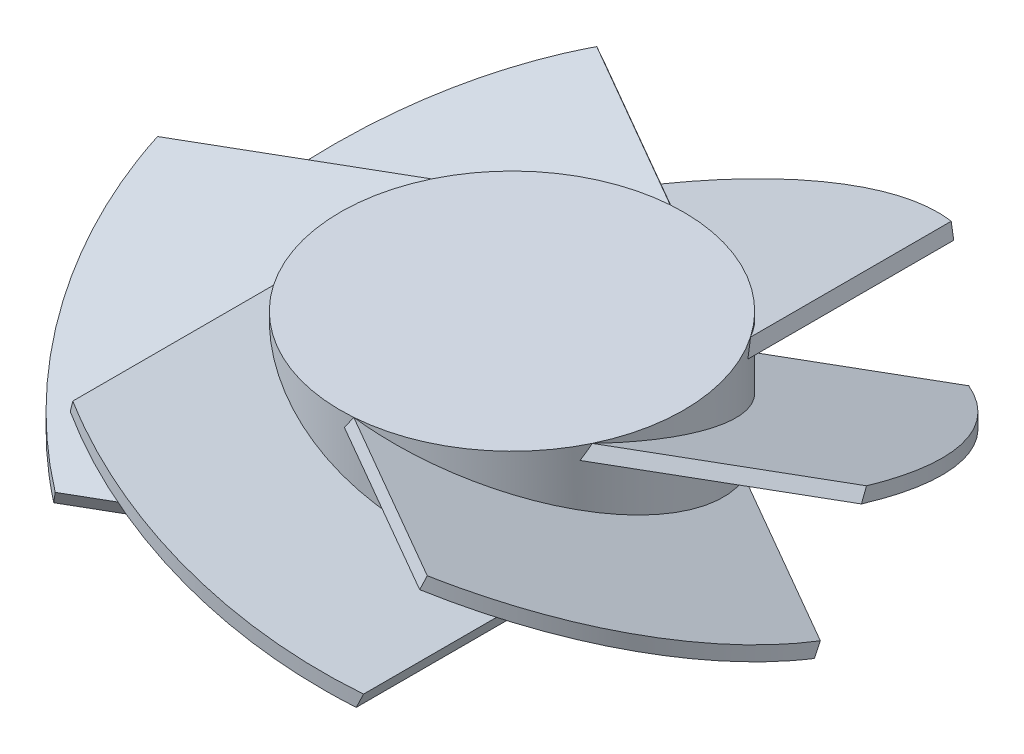
ISO-10303-21;
HEADER;
FILE_DESCRIPTION(('STEP AP214'),'2;1');
FILE_NAME('part.step','',(''),(''),'','','');
FILE_SCHEMA(('AUTOMOTIVE_DESIGN { 1 0 10303 214 1 1 1 1 }'));
ENDSEC;
DATA;
#1=APPLICATION_CONTEXT('core data for automotive mechanical design processes');
#2=APPLICATION_PROTOCOL_DEFINITION('international standard','automotive_design',2000,#1);
#3=PRODUCT_CONTEXT('',#1,'mechanical');
#4=PRODUCT('Part','Part','',(#3));
#5=PRODUCT_RELATED_PRODUCT_CATEGORY('part','',(#4));
#6=PRODUCT_DEFINITION_FORMATION('','',#4);
#7=PRODUCT_DEFINITION_CONTEXT('part definition',#1,'design');
#8=PRODUCT_DEFINITION('design','',#6,#7);
#9=PRODUCT_DEFINITION_SHAPE('','',#8);
#10=(LENGTH_UNIT() NAMED_UNIT(*) SI_UNIT(.MILLI.,.METRE.));
#11=(NAMED_UNIT(*) PLANE_ANGLE_UNIT() SI_UNIT($,.RADIAN.));
#12=(NAMED_UNIT(*) SI_UNIT($,.STERADIAN.) SOLID_ANGLE_UNIT());
#13=UNCERTAINTY_MEASURE_WITH_UNIT(LENGTH_MEASURE(1.E-05),#10,'distance_accuracy_value','');
#14=(GEOMETRIC_REPRESENTATION_CONTEXT(3) GLOBAL_UNCERTAINTY_ASSIGNED_CONTEXT((#13)) GLOBAL_UNIT_ASSIGNED_CONTEXT((#10,
#11,#12)) REPRESENTATION_CONTEXT('',''));
#15=CARTESIAN_POINT('',(0.,0.,0.));
#16=DIRECTION('',(0.,0.,1.));
#17=DIRECTION('',(1.,0.,0.));
#18=AXIS2_PLACEMENT_3D('',#15,#16,#17);
#19=CARTESIAN_POINT('',(-20.6458228220629,18.,10.0000000000001));
#20=DIRECTION('',(0.933525901422193,-0.358509959936795,0.));
#21=DIRECTION('',(0.358509959936795,0.933525901422193,0.));
#22=AXIS2_PLACEMENT_3D('',#19,#20,#21);
#23=PLANE('',#22);
#24=CARTESIAN_POINT('',(0.,71.7597626687053,0.));
#25=DIRECTION('',(0.933525901422193,-0.358509959936795,0.));
#26=DIRECTION('',(0.358509959936795,0.933525901422193,0.));
#27=AXIS2_PLACEMENT_3D('',#24,#25,#26);
#28=ELLIPSE('',#27,133.887493693236,48.0000000000001);
#29=CARTESIAN_POINT('',(-20.6458228220626,18.,43.3330128193276));
#30=VERTEX_POINT('',#29);
#31=CARTESIAN_POINT('',(-21.3628427419362,16.1329481971556,42.9840546014835));
#32=VERTEX_POINT('',#31);
#33=EDGE_CURVE('E498',#30,#32,#28,.T.);
#34=ORIENTED_EDGE('',*,*,#33,.F.);
#35=DIRECTION('',(0.,0.,1.));
#36=VECTOR('',#35,1.);
#37=CARTESIAN_POINT('',(-20.6458228220629,18.,10.0000000000001));
#38=LINE('',#37,#36);
#39=CARTESIAN_POINT('',(-20.6458228220628,18.,14.0978721798713));
#40=VERTEX_POINT('',#39);
#41=EDGE_CURVE('E390',#40,#30,#38,.T.);
#42=ORIENTED_EDGE('',*,*,#41,.F.);
#43=CARTESIAN_POINT('',(0.,71.7597626687053,0.));
#44=DIRECTION('',(0.933525901422193,-0.358509959936795,0.));
#45=DIRECTION('',(-0.358509959936795,-0.933525901422193,0.));
#46=AXIS2_PLACEMENT_3D('',#43,#44,#45);
#47=ELLIPSE('',#46,69.7330696318938,25.);
#48=CARTESIAN_POINT('',(-21.3628427419364,16.1329481971556,12.9857210035983));
#49=VERTEX_POINT('',#48);
#50=EDGE_CURVE('E414',#40,#49,#47,.T.);
#51=ORIENTED_EDGE('',*,*,#50,.T.);
#52=DIRECTION('',(0.,0.,1.));
#53=VECTOR('',#52,1.);
#54=CARTESIAN_POINT('',(-21.3628427419364,16.1329481971556,10.0000000000001));
#55=LINE('',#54,#53);
#56=EDGE_CURVE('E394',#49,#32,#55,.T.);
#57=ORIENTED_EDGE('',*,*,#56,.T.);
#58=EDGE_LOOP('',(#34,#42,#51,#57));
#59=FACE_BOUND('',#58,.T.);
#60=ADVANCED_FACE('F45',(#59),#23,.F.);
#61=CARTESIAN_POINT('',(21.3628427419359,1.8670518028444,9.99999999999986));
#62=DIRECTION('',(-0.358509959936791,-0.933525901422194,0.));
#63=DIRECTION('',(0.933525901422194,-0.358509959936791,0.));
#64=AXIS2_PLACEMENT_3D('',#61,#62,#63);
#65=PLANE('',#64);
#66=CARTESIAN_POINT('',(0.,10.0712075567228,0.));
#67=DIRECTION('',(-0.358509959936791,-0.933525901422194,0.));
#68=DIRECTION('',(-0.933525901422194,0.358509959936791,0.));
#69=AXIS2_PLACEMENT_3D('',#66,#67,#68);
#70=ELLIPSE('',#69,51.4179627226988,48.0000000000001);
#71=CARTESIAN_POINT('',(21.3628427419361,1.8670518028444,42.9840546014836));
#72=VERTEX_POINT('',#71);
#73=EDGE_CURVE('E501',#72,#30,#70,.T.);
#74=ORIENTED_EDGE('',*,*,#73,.F.);
#75=DIRECTION('',(0.,0.,1.));
#76=VECTOR('',#75,1.);
#77=CARTESIAN_POINT('',(21.3628427419359,1.8670518028444,9.99999999999986));
#78=LINE('',#77,#76);
#79=CARTESIAN_POINT('',(21.3628427419359,1.8670518028444,12.9857210035991));
#80=VERTEX_POINT('',#79);
#81=EDGE_CURVE('E386',#80,#72,#78,.T.);
#82=ORIENTED_EDGE('',*,*,#81,.F.);
#83=CARTESIAN_POINT('',(0.,10.0712075567228,0.));
#84=DIRECTION('',(-0.358509959936791,-0.933525901422194,0.));
#85=DIRECTION('',(0.933525901422194,-0.358509959936791,0.));
#86=AXIS2_PLACEMENT_3D('',#83,#84,#85);
#87=ELLIPSE('',#86,26.7801889180722,25.);
#88=EDGE_CURVE('E410',#80,#40,#87,.T.);
#89=ORIENTED_EDGE('',*,*,#88,.T.);
#90=ORIENTED_EDGE('',*,*,#41,.T.);
#91=EDGE_LOOP('',(#74,#82,#89,#90));
#92=FACE_BOUND('',#91,.T.);
#93=ADVANCED_FACE('F514',(#92),#65,.F.);
#94=CARTESIAN_POINT('',(21.3628427419359,1.8670518028444,9.99999999999986));
#95=DIRECTION('',(-0.933525901422194,0.358509959936791,0.));
#96=DIRECTION('',(-0.358509959936791,-0.933525901422194,0.));
#97=AXIS2_PLACEMENT_3D('',#94,#95,#96);
#98=PLANE('',#97);
#99=CARTESIAN_POINT('',(0.,-53.7597626687042,0.));
#100=DIRECTION('',(-0.933525901422194,0.358509959936791,0.));
#101=DIRECTION('',(0.358509959936791,0.933525901422194,0.));
#102=AXIS2_PLACEMENT_3D('',#99,#100,#101);
#103=ELLIPSE('',#102,133.887493693238,48.0000000000001);
#104=CARTESIAN_POINT('',(20.6458228220625,0.,43.3330128193276));
#105=VERTEX_POINT('',#104);
#106=EDGE_CURVE('E486',#105,#72,#103,.T.);
#107=ORIENTED_EDGE('',*,*,#106,.F.);
#108=DIRECTION('',(0.,0.,1.));
#109=VECTOR('',#108,1.);
#110=CARTESIAN_POINT('',(20.6458228220623,0.,9.99999999999986));
#111=LINE('',#110,#109);
#112=CARTESIAN_POINT('',(20.6458228220624,0.,14.097872179872));
#113=VERTEX_POINT('',#112);
#114=EDGE_CURVE('E398',#113,#105,#111,.T.);
#115=ORIENTED_EDGE('',*,*,#114,.F.);
#116=CARTESIAN_POINT('',(0.,-53.7597626687042,0.));
#117=DIRECTION('',(-0.933525901422194,0.358509959936791,0.));
#118=DIRECTION('',(-0.358509959936791,-0.933525901422194,0.));
#119=AXIS2_PLACEMENT_3D('',#116,#117,#118);
#120=ELLIPSE('',#119,69.7330696318946,25.);
#121=EDGE_CURVE('E406',#113,#80,#120,.T.);
#122=ORIENTED_EDGE('',*,*,#121,.T.);
#123=ORIENTED_EDGE('',*,*,#81,.T.);
#124=EDGE_LOOP('',(#107,#115,#122,#123));
#125=FACE_BOUND('',#124,.T.);
#126=ADVANCED_FACE('F520',(#125),#98,.F.);
#127=CARTESIAN_POINT('',(20.6458228220623,0.,9.99999999999986));
#128=DIRECTION('',(0.358509959936791,0.933525901422194,0.));
#129=DIRECTION('',(-0.933525901422194,0.358509959936791,0.));
#130=AXIS2_PLACEMENT_3D('',#127,#128,#129);
#131=PLANE('',#130);
#132=CARTESIAN_POINT('',(0.,7.92879244327699,0.));
#133=DIRECTION('',(0.358509959936791,0.933525901422194,0.));
#134=DIRECTION('',(-0.933525901422194,0.358509959936791,0.));
#135=AXIS2_PLACEMENT_3D('',#132,#133,#134);
#136=ELLIPSE('',#135,51.4179627226988,48.0000000000001);
#137=EDGE_CURVE('E241',#32,#105,#136,.T.);
#138=ORIENTED_EDGE('',*,*,#137,.F.);
#139=ORIENTED_EDGE('',*,*,#56,.F.);
#140=CARTESIAN_POINT('',(0.,7.92879244327699,0.));
#141=DIRECTION('',(0.358509959936791,0.933525901422194,0.));
#142=DIRECTION('',(0.933525901422194,-0.358509959936791,0.));
#143=AXIS2_PLACEMENT_3D('',#140,#141,#142);
#144=ELLIPSE('',#143,26.7801889180722,25.);
#145=EDGE_CURVE('E402',#49,#113,#144,.T.);
#146=ORIENTED_EDGE('',*,*,#145,.T.);
#147=ORIENTED_EDGE('',*,*,#114,.T.);
#148=EDGE_LOOP('',(#138,#139,#146,#147));
#149=FACE_BOUND('',#148,.T.);
#150=ADVANCED_FACE('F511',(#149),#131,.F.);
#151=CARTESIAN_POINT('',(-18.9831654488759,18.,-12.8798070459389));
#152=DIRECTION('',(0.4667629507111,-0.358509959936795,0.808457145722384));
#153=DIRECTION('',(0.866025403784436,0.,-0.500000000000004));
#154=AXIS2_PLACEMENT_3D('',#151,#152,#153);
#155=PLANE('',#154);
#156=CARTESIAN_POINT('',(0.,71.7597626687053,0.));
#157=DIRECTION('',(0.4667629507111,-0.358509959936795,0.808457145722384));
#158=DIRECTION('',(0.179254979968399,0.933525901422193,0.310478732815005));
#159=AXIS2_PLACEMENT_3D('',#156,#157,#158);
#160=ELLIPSE('',#159,133.887493693236,48.0000000000001);
#161=CARTESIAN_POINT('',(-47.8504013350858,18.,3.78669936372492));
#162=VERTEX_POINT('',#161);
#163=CARTESIAN_POINT('',(-47.9067046135103,16.1329481971556,2.99126278917287));
#164=VERTEX_POINT('',#163);
#165=EDGE_CURVE('E487',#162,#164,#160,.T.);
#166=ORIENTED_EDGE('',*,*,#165,.F.);
#167=DIRECTION('',(-0.866025403784436,0.,0.500000000000004));
#168=VECTOR('',#167,1.);
#169=CARTESIAN_POINT('',(-18.9831654488759,18.,-12.8798070459389));
#170=LINE('',#169,#168);
#171=CARTESIAN_POINT('',(-22.5320268581058,18.,-10.8308709560033));
#172=VERTEX_POINT('',#171);
#173=EDGE_CURVE('E358',#172,#162,#170,.T.);
#174=ORIENTED_EDGE('',*,*,#173,.F.);
#175=CARTESIAN_POINT('',(0.,71.7597626687053,0.));
#176=DIRECTION('',(0.4667629507111,-0.358509959936795,0.808457145722384));
#177=DIRECTION('',(-0.179254979968399,-0.933525901422193,-0.310478732815005));
#178=AXIS2_PLACEMENT_3D('',#175,#176,#177);
#179=ELLIPSE('',#178,69.7330696318938,25.);
#180=CARTESIAN_POINT('',(-21.9273856465415,16.1329481971556,-12.0079040097699));
#181=VERTEX_POINT('',#180);
#182=EDGE_CURVE('E382',#172,#181,#179,.T.);
#183=ORIENTED_EDGE('',*,*,#182,.T.);
#184=DIRECTION('',(-0.866025403784436,0.,0.500000000000004));
#185=VECTOR('',#184,1.);
#186=CARTESIAN_POINT('',(-19.3416754088127,16.1329481971556,-13.5007645115689));
#187=LINE('',#186,#185);
#188=EDGE_CURVE('E362',#181,#164,#187,.T.);
#189=ORIENTED_EDGE('',*,*,#188,.T.);
#190=EDGE_LOOP('',(#166,#174,#183,#189));
#191=FACE_BOUND('',#190,.T.);
#192=ADVANCED_FACE('F527',(#191),#155,.F.);
#193=CARTESIAN_POINT('',(2.02116733312363,1.8670518028444,23.5007645115684));
#194=DIRECTION('',(-0.179254979968397,-0.933525901422194,-0.310478732815002));
#195=DIRECTION('',(0.,0.315590462308943,-0.948895494825235));
#196=AXIS2_PLACEMENT_3D('',#193,#194,#195);
#197=PLANE('',#196);
#198=CARTESIAN_POINT('',(0.,10.0712075567228,0.));
#199=DIRECTION('',(-0.179254979968397,-0.933525901422194,-0.310478732815002));
#200=DIRECTION('',(-0.466762950711101,0.358509959936791,-0.808457145722386));
#201=AXIS2_PLACEMENT_3D('',#198,#199,#200);
#202=ELLIPSE('',#201,51.4179627226988,48.0000000000001);
#203=CARTESIAN_POINT('',(-26.5438618715742,1.8670518028444,39.9927918123104));
#204=VERTEX_POINT('',#203);
#205=EDGE_CURVE('E491',#204,#162,#202,.T.);
#206=ORIENTED_EDGE('',*,*,#205,.F.);
#207=DIRECTION('',(-0.866025403784436,0.,0.500000000000004));
#208=VECTOR('',#207,1.);
#209=CARTESIAN_POINT('',(2.02116733312363,1.8670518028444,23.5007645115684));
#210=LINE('',#209,#208);
#211=CARTESIAN_POINT('',(-0.564542904606123,1.8670518028444,24.9936250133681));
#212=VERTEX_POINT('',#211);
#213=EDGE_CURVE('E354',#212,#204,#210,.T.);
#214=ORIENTED_EDGE('',*,*,#213,.F.);
#215=CARTESIAN_POINT('',(0.,10.0712075567228,0.));
#216=DIRECTION('',(-0.179254979968397,-0.933525901422194,-0.310478732815002));
#217=DIRECTION('',(0.466762950711101,-0.358509959936791,0.808457145722386));
#218=AXIS2_PLACEMENT_3D('',#215,#216,#217);
#219=ELLIPSE('',#218,26.7801889180722,25.);
#220=EDGE_CURVE('E378',#212,#172,#219,.T.);
#221=ORIENTED_EDGE('',*,*,#220,.T.);
#222=ORIENTED_EDGE('',*,*,#173,.T.);
#223=EDGE_LOOP('',(#206,#214,#221,#222));
#224=FACE_BOUND('',#223,.T.);
#225=ADVANCED_FACE('F571',(#224),#197,.F.);
#226=CARTESIAN_POINT('',(2.02116733312363,1.8670518028444,23.5007645115684));
#227=DIRECTION('',(-0.466762950711101,0.358509959936791,-0.808457145722386));
#228=DIRECTION('',(-0.866025403784436,0.,0.500000000000004));
#229=AXIS2_PLACEMENT_3D('',#226,#227,#228);
#230=PLANE('',#229);
#231=CARTESIAN_POINT('',(0.,-53.7597626687042,0.));
#232=DIRECTION('',(-0.466762950711101,0.358509959936791,-0.808457145722386));
#233=DIRECTION('',(0.179254979968397,0.933525901422194,0.310478732815002));
#234=AXIS2_PLACEMENT_3D('',#231,#232,#233);
#235=ELLIPSE('',#234,133.887493693238,48.0000000000001);
#236=CARTESIAN_POINT('',(-27.2045785130233,0.,39.5463134556024));
#237=VERTEX_POINT('',#236);
#238=EDGE_CURVE('E488',#237,#204,#235,.T.);
#239=ORIENTED_EDGE('',*,*,#238,.F.);
#240=DIRECTION('',(-0.866025403784436,0.,0.500000000000004));
#241=VECTOR('',#240,1.);
#242=CARTESIAN_POINT('',(1.66265737318684,0.,22.8798070459384));
#243=LINE('',#242,#241);
#244=CARTESIAN_POINT('',(-1.88620403604394,0.,24.9287431358745));
#245=VERTEX_POINT('',#244);
#246=EDGE_CURVE('E366',#245,#237,#243,.T.);
#247=ORIENTED_EDGE('',*,*,#246,.F.);
#248=CARTESIAN_POINT('',(0.,-53.7597626687042,0.));
#249=DIRECTION('',(-0.466762950711101,0.358509959936791,-0.808457145722386));
#250=DIRECTION('',(-0.179254979968397,-0.933525901422194,-0.310478732815002));
#251=AXIS2_PLACEMENT_3D('',#248,#249,#250);
#252=ELLIPSE('',#251,69.7330696318946,25.);
#253=EDGE_CURVE('E374',#245,#212,#252,.T.);
#254=ORIENTED_EDGE('',*,*,#253,.T.);
#255=ORIENTED_EDGE('',*,*,#213,.T.);
#256=EDGE_LOOP('',(#239,#247,#254,#255));
#257=FACE_BOUND('',#256,.T.);
#258=ADVANCED_FACE('F564',(#257),#230,.F.);
#259=CARTESIAN_POINT('',(1.66265737318684,0.,22.8798070459384));
#260=DIRECTION('',(0.179254979968397,0.933525901422194,0.310478732815002));
#261=DIRECTION('',(0.,-0.315590462308943,0.948895494825235));
#262=AXIS2_PLACEMENT_3D('',#259,#260,#261);
#263=PLANE('',#262);
#264=CARTESIAN_POINT('',(0.,7.92879244327698,0.));
#265=DIRECTION('',(0.179254979968397,0.933525901422194,0.310478732815002));
#266=DIRECTION('',(-0.466762950711101,0.358509959936791,-0.808457145722386));
#267=AXIS2_PLACEMENT_3D('',#264,#265,#266);
#268=ELLIPSE('',#267,51.4179627226988,48.0000000000001);
#269=EDGE_CURVE('E483',#164,#237,#268,.T.);
#270=ORIENTED_EDGE('',*,*,#269,.F.);
#271=ORIENTED_EDGE('',*,*,#188,.F.);
#272=CARTESIAN_POINT('',(0.,7.92879244327698,0.));
#273=DIRECTION('',(0.179254979968397,0.933525901422194,0.310478732815002));
#274=DIRECTION('',(0.466762950711101,-0.358509959936791,0.808457145722386));
#275=AXIS2_PLACEMENT_3D('',#272,#273,#274);
#276=ELLIPSE('',#275,26.7801889180722,25.);
#277=EDGE_CURVE('E370',#181,#245,#276,.T.);
#278=ORIENTED_EDGE('',*,*,#277,.T.);
#279=ORIENTED_EDGE('',*,*,#246,.T.);
#280=EDGE_LOOP('',(#270,#271,#278,#279));
#281=FACE_BOUND('',#280,.T.);
#282=ADVANCED_FACE('F566',(#281),#263,.F.);
#283=CARTESIAN_POINT('',(1.66265737318701,18.,-22.879807045939));
#284=DIRECTION('',(-0.466762950711095,-0.358509959936795,0.808457145722387));
#285=DIRECTION('',(0.86602540378444,0.,0.499999999999998));
#286=AXIS2_PLACEMENT_3D('',#283,#284,#285);
#287=PLANE('',#286);
#288=CARTESIAN_POINT('',(0.,71.7597626687053,0.));
#289=DIRECTION('',(-0.466762950711095,-0.358509959936795,0.808457145722387));
#290=DIRECTION('',(-0.179254979968397,0.933525901422193,0.310478732815007));
#291=AXIS2_PLACEMENT_3D('',#288,#289,#290);
#292=ELLIPSE('',#291,133.887493693236,48.0000000000001);
#293=CARTESIAN_POINT('',(-27.2045785130229,18.,-39.5463134556027));
#294=VERTEX_POINT('',#293);
#295=CARTESIAN_POINT('',(-26.5438618715738,16.1329481971556,-39.9927918123107));
#296=VERTEX_POINT('',#295);
#297=EDGE_CURVE('E473',#294,#296,#292,.T.);
#298=ORIENTED_EDGE('',*,*,#297,.F.);
#299=DIRECTION('',(-0.86602540378444,0.,-0.499999999999998));
#300=VECTOR('',#299,1.);
#301=CARTESIAN_POINT('',(1.66265737318701,18.,-22.879807045939));
#302=LINE('',#301,#300);
#303=CARTESIAN_POINT('',(-1.88620403604293,18.,-24.9287431358746));
#304=VERTEX_POINT('',#303);
#305=EDGE_CURVE('E326',#304,#294,#302,.T.);
#306=ORIENTED_EDGE('',*,*,#305,.F.);
#307=CARTESIAN_POINT('',(0.,71.7597626687053,0.));
#308=DIRECTION('',(-0.466762950711095,-0.358509959936795,0.808457145722387));
#309=DIRECTION('',(0.179254979968397,-0.933525901422193,-0.310478732815007));
#310=AXIS2_PLACEMENT_3D('',#307,#308,#309);
#311=ELLIPSE('',#310,69.7330696318938,25.);
#312=CARTESIAN_POINT('',(-0.564542904604952,16.1329481971556,-24.9936250133681));
#313=VERTEX_POINT('',#312);
#314=EDGE_CURVE('E350',#304,#313,#311,.T.);
#315=ORIENTED_EDGE('',*,*,#314,.T.);
#316=DIRECTION('',(-0.86602540378444,0.,-0.499999999999998));
#317=VECTOR('',#316,1.);
#318=CARTESIAN_POINT('',(2.02116733312381,16.1329481971556,-23.500764511569));
#319=LINE('',#318,#317);
#320=EDGE_CURVE('E330',#313,#296,#319,.T.);
#321=ORIENTED_EDGE('',*,*,#320,.T.);
#322=EDGE_LOOP('',(#298,#306,#315,#321));
#323=FACE_BOUND('',#322,.T.);
#324=ADVANCED_FACE('F639',(#323),#287,.F.);
#325=CARTESIAN_POINT('',(-19.3416754088123,1.8670518028444,13.5007645115685));
#326=DIRECTION('',(0.179254979968395,-0.933525901422194,-0.310478732815003));
#327=DIRECTION('',(0.,0.315590462308944,-0.948895494825235));
#328=AXIS2_PLACEMENT_3D('',#325,#326,#327);
#329=PLANE('',#328);
#330=CARTESIAN_POINT('',(0.,10.0712075567228,0.));
#331=DIRECTION('',(0.179254979968395,-0.933525901422194,-0.310478732815003));
#332=DIRECTION('',(0.466762950711095,0.358509959936791,-0.808457145722389));
#333=AXIS2_PLACEMENT_3D('',#330,#331,#332);
#334=ELLIPSE('',#333,51.4179627226988,48.0000000000001);
#335=CARTESIAN_POINT('',(-47.9067046135102,1.8670518028444,-2.99126278917331));
#336=VERTEX_POINT('',#335);
#337=EDGE_CURVE('E468',#336,#294,#334,.T.);
#338=ORIENTED_EDGE('',*,*,#337,.F.);
#339=DIRECTION('',(-0.86602540378444,0.,-0.499999999999998));
#340=VECTOR('',#339,1.);
#341=CARTESIAN_POINT('',(-19.3416754088123,1.8670518028444,13.5007645115685));
#342=LINE('',#341,#340);
#343=CARTESIAN_POINT('',(-21.927385646542,1.8670518028444,12.0079040097688));
#344=VERTEX_POINT('',#343);
#345=EDGE_CURVE('E322',#344,#336,#342,.T.);
#346=ORIENTED_EDGE('',*,*,#345,.F.);
#347=CARTESIAN_POINT('',(0.,10.0712075567228,0.));
#348=DIRECTION('',(0.179254979968395,-0.933525901422194,-0.310478732815003));
#349=DIRECTION('',(-0.466762950711095,-0.358509959936791,0.808457145722389));
#350=AXIS2_PLACEMENT_3D('',#347,#348,#349);
#351=ELLIPSE('',#350,26.7801889180722,25.);
#352=EDGE_CURVE('E346',#344,#304,#351,.T.);
#353=ORIENTED_EDGE('',*,*,#352,.T.);
#354=ORIENTED_EDGE('',*,*,#305,.T.);
#355=EDGE_LOOP('',(#338,#346,#353,#354));
#356=FACE_BOUND('',#355,.T.);
#357=ADVANCED_FACE('F636',(#356),#329,.F.);
#358=CARTESIAN_POINT('',(-19.3416754088123,1.8670518028444,13.5007645115685));
#359=DIRECTION('',(0.466762950711095,0.358509959936791,-0.808457145722389));
#360=DIRECTION('',(-0.86602540378444,0.,-0.499999999999998));
#361=AXIS2_PLACEMENT_3D('',#358,#359,#360);
#362=PLANE('',#361);
#363=CARTESIAN_POINT('',(0.,-53.7597626687042,0.));
#364=DIRECTION('',(0.466762950711095,0.358509959936791,-0.808457145722389));
#365=DIRECTION('',(-0.179254979968395,0.933525901422194,0.310478732815003));
#366=AXIS2_PLACEMENT_3D('',#363,#364,#365);
#367=ELLIPSE('',#366,133.887493693238,48.0000000000001);
#368=CARTESIAN_POINT('',(-47.8504013350857,0.,-3.78669936372536));
#369=VERTEX_POINT('',#368);
#370=EDGE_CURVE('E464',#369,#336,#367,.T.);
#371=ORIENTED_EDGE('',*,*,#370,.F.);
#372=DIRECTION('',(-0.86602540378444,0.,-0.499999999999998));
#373=VECTOR('',#372,1.);
#374=CARTESIAN_POINT('',(-18.9831654488755,0.,12.8798070459385));
#375=LINE('',#374,#373);
#376=CARTESIAN_POINT('',(-22.5320268581063,0.,10.8308709560024));
#377=VERTEX_POINT('',#376);
#378=EDGE_CURVE('E334',#377,#369,#375,.T.);
#379=ORIENTED_EDGE('',*,*,#378,.F.);
#380=CARTESIAN_POINT('',(0.,-53.7597626687042,0.));
#381=DIRECTION('',(0.466762950711095,0.358509959936791,-0.808457145722389));
#382=DIRECTION('',(0.179254979968395,-0.933525901422194,-0.310478732815003));
#383=AXIS2_PLACEMENT_3D('',#380,#381,#382);
#384=ELLIPSE('',#383,69.7330696318946,25.);
#385=EDGE_CURVE('E342',#377,#344,#384,.T.);
#386=ORIENTED_EDGE('',*,*,#385,.T.);
#387=ORIENTED_EDGE('',*,*,#345,.T.);
#388=EDGE_LOOP('',(#371,#379,#386,#387));
#389=FACE_BOUND('',#388,.T.);
#390=ADVANCED_FACE('F463',(#389),#362,.F.);
#391=CARTESIAN_POINT('',(-18.9831654488755,0.,12.8798070459385));
#392=DIRECTION('',(-0.179254979968395,0.933525901422194,0.310478732815003));
#393=DIRECTION('',(0.,-0.315590462308944,0.948895494825235));
#394=AXIS2_PLACEMENT_3D('',#391,#392,#393);
#395=PLANE('',#394);
#396=CARTESIAN_POINT('',(0.,7.92879244327699,0.));
#397=DIRECTION('',(-0.179254979968395,0.933525901422194,0.310478732815003));
#398=DIRECTION('',(0.466762950711095,0.358509959936791,-0.808457145722389));
#399=AXIS2_PLACEMENT_3D('',#396,#397,#398);
#400=ELLIPSE('',#399,51.4179627226988,48.0000000000001);
#401=EDGE_CURVE('E478',#296,#369,#400,.T.);
#402=ORIENTED_EDGE('',*,*,#401,.F.);
#403=ORIENTED_EDGE('',*,*,#320,.F.);
#404=CARTESIAN_POINT('',(0.,7.92879244327699,0.));
#405=DIRECTION('',(-0.179254979968395,0.933525901422194,0.310478732815003));
#406=DIRECTION('',(-0.466762950711095,-0.358509959936791,0.808457145722389));
#407=AXIS2_PLACEMENT_3D('',#404,#405,#406);
#408=ELLIPSE('',#407,26.7801889180722,25.);
#409=EDGE_CURVE('E338',#313,#377,#408,.T.);
#410=ORIENTED_EDGE('',*,*,#409,.T.);
#411=ORIENTED_EDGE('',*,*,#378,.T.);
#412=EDGE_LOOP('',(#402,#403,#410,#411));
#413=FACE_BOUND('',#412,.T.);
#414=ADVANCED_FACE('F461',(#413),#395,.F.);
#415=CARTESIAN_POINT('',(20.6458228220629,18.,-10.0000000000001));
#416=DIRECTION('',(-0.933525901422193,-0.358509959936795,0.));
#417=DIRECTION('',(0.358509959936795,-0.933525901422193,0.));
#418=AXIS2_PLACEMENT_3D('',#415,#416,#417);
#419=PLANE('',#418);
#420=CARTESIAN_POINT('',(0.,71.7597626687053,0.));
#421=DIRECTION('',(-0.933525901422193,-0.358509959936795,0.));
#422=DIRECTION('',(-0.358509959936795,0.933525901422193,0.));
#423=AXIS2_PLACEMENT_3D('',#420,#421,#422);
#424=ELLIPSE('',#423,133.887493693236,48.0000000000001);
#425=CARTESIAN_POINT('',(20.6458228220626,18.,-43.3330128193276));
#426=VERTEX_POINT('',#425);
#427=CARTESIAN_POINT('',(21.3628427419362,16.1329481971556,-42.9840546014835));
#428=VERTEX_POINT('',#427);
#429=EDGE_CURVE('E475',#426,#428,#424,.T.);
#430=ORIENTED_EDGE('',*,*,#429,.F.);
#431=DIRECTION('',(0.,0.,-1.));
#432=VECTOR('',#431,1.);
#433=CARTESIAN_POINT('',(20.6458228220629,18.,-10.0000000000001));
#434=LINE('',#433,#432);
#435=CARTESIAN_POINT('',(20.6458228220628,18.,-14.0978721798713));
#436=VERTEX_POINT('',#435);
#437=EDGE_CURVE('E294',#436,#426,#434,.T.);
#438=ORIENTED_EDGE('',*,*,#437,.F.);
#439=CARTESIAN_POINT('',(0.,71.7597626687053,0.));
#440=DIRECTION('',(-0.933525901422193,-0.358509959936795,0.));
#441=DIRECTION('',(0.358509959936795,-0.933525901422193,0.));
#442=AXIS2_PLACEMENT_3D('',#439,#440,#441);
#443=ELLIPSE('',#442,69.7330696318938,25.);
#444=CARTESIAN_POINT('',(21.3628427419364,16.1329481971556,-12.9857210035983));
#445=VERTEX_POINT('',#444);
#446=EDGE_CURVE('E318',#436,#445,#443,.T.);
#447=ORIENTED_EDGE('',*,*,#446,.T.);
#448=DIRECTION('',(0.,0.,-1.));
#449=VECTOR('',#448,1.);
#450=CARTESIAN_POINT('',(21.3628427419364,16.1329481971556,-10.0000000000001));
#451=LINE('',#450,#449);
#452=EDGE_CURVE('E298',#445,#428,#451,.T.);
#453=ORIENTED_EDGE('',*,*,#452,.T.);
#454=EDGE_LOOP('',(#430,#438,#447,#453));
#455=FACE_BOUND('',#454,.T.);
#456=ADVANCED_FACE('F612',(#455),#419,.F.);
#457=CARTESIAN_POINT('',(-21.3628427419359,1.8670518028444,-9.99999999999986));
#458=DIRECTION('',(0.358509959936791,-0.933525901422194,0.));
#459=DIRECTION('',(0.933525901422194,0.358509959936791,0.));
#460=AXIS2_PLACEMENT_3D('',#457,#458,#459);
#461=PLANE('',#460);
#462=CARTESIAN_POINT('',(0.,10.0712075567228,0.));
#463=DIRECTION('',(0.358509959936791,-0.933525901422194,0.));
#464=DIRECTION('',(0.933525901422194,0.358509959936791,0.));
#465=AXIS2_PLACEMENT_3D('',#462,#463,#464);
#466=ELLIPSE('',#465,51.4179627226988,48.0000000000001);
#467=CARTESIAN_POINT('',(-21.3628427419361,1.8670518028444,-42.9840546014836));
#468=VERTEX_POINT('',#467);
#469=EDGE_CURVE('E598',#468,#426,#466,.T.);
#470=ORIENTED_EDGE('',*,*,#469,.F.);
#471=DIRECTION('',(0.,0.,-1.));
#472=VECTOR('',#471,1.);
#473=CARTESIAN_POINT('',(-21.3628427419359,1.8670518028444,-9.99999999999986));
#474=LINE('',#473,#472);
#475=CARTESIAN_POINT('',(-21.3628427419359,1.8670518028444,-12.9857210035991));
#476=VERTEX_POINT('',#475);
#477=EDGE_CURVE('E290',#476,#468,#474,.T.);
#478=ORIENTED_EDGE('',*,*,#477,.F.);
#479=CARTESIAN_POINT('',(0.,10.0712075567228,0.));
#480=DIRECTION('',(0.358509959936791,-0.933525901422194,0.));
#481=DIRECTION('',(-0.933525901422194,-0.358509959936791,0.));
#482=AXIS2_PLACEMENT_3D('',#479,#480,#481);
#483=ELLIPSE('',#482,26.7801889180722,25.);
#484=EDGE_CURVE('E314',#476,#436,#483,.T.);
#485=ORIENTED_EDGE('',*,*,#484,.T.);
#486=ORIENTED_EDGE('',*,*,#437,.T.);
#487=EDGE_LOOP('',(#470,#478,#485,#486));
#488=FACE_BOUND('',#487,.T.);
#489=ADVANCED_FACE('F620',(#488),#461,.F.);
#490=CARTESIAN_POINT('',(-21.3628427419359,1.8670518028444,-9.99999999999986));
#491=DIRECTION('',(0.933525901422194,0.358509959936791,0.));
#492=DIRECTION('',(-0.358509959936791,0.933525901422194,0.));
#493=AXIS2_PLACEMENT_3D('',#490,#491,#492);
#494=PLANE('',#493);
#495=CARTESIAN_POINT('',(0.,-53.7597626687042,0.));
#496=DIRECTION('',(0.933525901422194,0.358509959936791,0.));
#497=DIRECTION('',(-0.358509959936791,0.933525901422194,0.));
#498=AXIS2_PLACEMENT_3D('',#495,#496,#497);
#499=ELLIPSE('',#498,133.887493693238,48.0000000000001);
#500=CARTESIAN_POINT('',(-20.6458228220625,0.,-43.3330128193276));
#501=VERTEX_POINT('',#500);
#502=EDGE_CURVE('E589',#501,#468,#499,.T.);
#503=ORIENTED_EDGE('',*,*,#502,.F.);
#504=DIRECTION('',(0.,0.,-1.));
#505=VECTOR('',#504,1.);
#506=CARTESIAN_POINT('',(-20.6458228220623,0.,-9.99999999999986));
#507=LINE('',#506,#505);
#508=CARTESIAN_POINT('',(-20.6458228220624,0.,-14.097872179872));
#509=VERTEX_POINT('',#508);
#510=EDGE_CURVE('E302',#509,#501,#507,.T.);
#511=ORIENTED_EDGE('',*,*,#510,.F.);
#512=CARTESIAN_POINT('',(0.,-53.7597626687042,0.));
#513=DIRECTION('',(0.933525901422194,0.358509959936791,0.));
#514=DIRECTION('',(0.358509959936791,-0.933525901422194,0.));
#515=AXIS2_PLACEMENT_3D('',#512,#513,#514);
#516=ELLIPSE('',#515,69.7330696318946,25.);
#517=EDGE_CURVE('E310',#509,#476,#516,.T.);
#518=ORIENTED_EDGE('',*,*,#517,.T.);
#519=ORIENTED_EDGE('',*,*,#477,.T.);
#520=EDGE_LOOP('',(#503,#511,#518,#519));
#521=FACE_BOUND('',#520,.T.);
#522=ADVANCED_FACE('F624',(#521),#494,.F.);
#523=CARTESIAN_POINT('',(-20.6458228220623,0.,-9.99999999999986));
#524=DIRECTION('',(-0.358509959936791,0.933525901422194,0.));
#525=DIRECTION('',(-0.933525901422194,-0.358509959936791,0.));
#526=AXIS2_PLACEMENT_3D('',#523,#524,#525);
#527=PLANE('',#526);
#528=CARTESIAN_POINT('',(0.,7.92879244327699,0.));
#529=DIRECTION('',(-0.358509959936791,0.933525901422194,0.));
#530=DIRECTION('',(0.933525901422194,0.358509959936791,0.));
#531=AXIS2_PLACEMENT_3D('',#528,#529,#530);
#532=ELLIPSE('',#531,51.4179627226988,48.0000000000001);
#533=EDGE_CURVE('E469',#428,#501,#532,.T.);
#534=ORIENTED_EDGE('',*,*,#533,.F.);
#535=ORIENTED_EDGE('',*,*,#452,.F.);
#536=CARTESIAN_POINT('',(0.,7.92879244327699,0.));
#537=DIRECTION('',(-0.358509959936791,0.933525901422194,0.));
#538=DIRECTION('',(-0.933525901422194,-0.358509959936791,0.));
#539=AXIS2_PLACEMENT_3D('',#536,#537,#538);
#540=ELLIPSE('',#539,26.7801889180722,25.);
#541=EDGE_CURVE('E306',#445,#509,#540,.T.);
#542=ORIENTED_EDGE('',*,*,#541,.T.);
#543=ORIENTED_EDGE('',*,*,#510,.T.);
#544=EDGE_LOOP('',(#534,#535,#542,#543));
#545=FACE_BOUND('',#544,.T.);
#546=ADVANCED_FACE('F610',(#545),#527,.F.);
#547=CARTESIAN_POINT('',(18.9831654488758,18.,12.8798070459391));
#548=DIRECTION('',(-0.466762950711095,-0.358509959936795,-0.808457145722388));
#549=DIRECTION('',(-0.86602540378444,0.,0.499999999999998));
#550=AXIS2_PLACEMENT_3D('',#547,#548,#549);
#551=PLANE('',#550);
#552=CARTESIAN_POINT('',(0.,71.7597626687053,0.));
#553=DIRECTION('',(-0.466762950711095,-0.358509959936795,-0.808457145722388));
#554=DIRECTION('',(-0.179254979968397,0.933525901422193,-0.310478732815007));
#555=AXIS2_PLACEMENT_3D('',#552,#553,#554);
#556=ELLIPSE('',#555,133.887493693236,48.0000000000001);
#557=CARTESIAN_POINT('',(47.8504013350858,18.,-3.78669936372459));
#558=VERTEX_POINT('',#557);
#559=CARTESIAN_POINT('',(47.9067046135103,16.1329481971556,-2.99126278917253));
#560=VERTEX_POINT('',#559);
#561=EDGE_CURVE('E590',#558,#560,#556,.T.);
#562=ORIENTED_EDGE('',*,*,#561,.F.);
#563=DIRECTION('',(0.86602540378444,0.,-0.499999999999998));
#564=VECTOR('',#563,1.);
#565=CARTESIAN_POINT('',(18.9831654488758,18.,12.8798070459391));
#566=LINE('',#565,#564);
#567=CARTESIAN_POINT('',(22.5320268581058,18.,10.8308709560035));
#568=VERTEX_POINT('',#567);
#569=EDGE_CURVE('E262',#568,#558,#566,.T.);
#570=ORIENTED_EDGE('',*,*,#569,.F.);
#571=CARTESIAN_POINT('',(0.,71.7597626687053,0.));
#572=DIRECTION('',(-0.466762950711095,-0.358509959936795,-0.808457145722388));
#573=DIRECTION('',(0.179254979968397,-0.933525901422193,0.310478732815007));
#574=AXIS2_PLACEMENT_3D('',#571,#572,#573);
#575=ELLIPSE('',#574,69.7330696318938,25.);
#576=CARTESIAN_POINT('',(21.9273856465414,16.1329481971556,12.00790400977));
#577=VERTEX_POINT('',#576);
#578=EDGE_CURVE('E286',#568,#577,#575,.T.);
#579=ORIENTED_EDGE('',*,*,#578,.T.);
#580=DIRECTION('',(0.86602540378444,0.,-0.499999999999998));
#581=VECTOR('',#580,1.);
#582=CARTESIAN_POINT('',(19.3416754088126,16.1329481971556,13.5007645115691));
#583=LINE('',#582,#581);
#584=EDGE_CURVE('E266',#577,#560,#583,.T.);
#585=ORIENTED_EDGE('',*,*,#584,.T.);
#586=EDGE_LOOP('',(#562,#570,#579,#585));
#587=FACE_BOUND('',#586,.T.);
#588=ADVANCED_FACE('F631',(#587),#551,.F.);
#589=CARTESIAN_POINT('',(-2.02116733312346,1.8670518028444,-23.5007645115684));
#590=DIRECTION('',(0.179254979968395,-0.933525901422194,0.310478732815003));
#591=DIRECTION('',(0.,-0.315590462308944,-0.948895494825235));
#592=AXIS2_PLACEMENT_3D('',#589,#590,#591);
#593=PLANE('',#592);
#594=CARTESIAN_POINT('',(0.,10.0712075567228,0.));
#595=DIRECTION('',(0.179254979968395,-0.933525901422194,0.310478732815003));
#596=DIRECTION('',(0.466762950711095,0.358509959936791,0.808457145722389));
#597=AXIS2_PLACEMENT_3D('',#594,#595,#596);
#598=ELLIPSE('',#597,51.4179627226988,48.0000000000001);
#599=CARTESIAN_POINT('',(26.5438618715745,1.8670518028444,-39.9927918123102));
#600=VERTEX_POINT('',#599);
#601=EDGE_CURVE('E582',#600,#558,#598,.T.);
#602=ORIENTED_EDGE('',*,*,#601,.F.);
#603=DIRECTION('',(0.86602540378444,0.,-0.499999999999998));
#604=VECTOR('',#603,1.);
#605=CARTESIAN_POINT('',(-2.02116733312346,1.8670518028444,-23.5007645115684));
#606=LINE('',#605,#604);
#607=CARTESIAN_POINT('',(0.564542904606294,1.8670518028444,-24.9936250133681));
#608=VERTEX_POINT('',#607);
#609=EDGE_CURVE('E258',#608,#600,#606,.T.);
#610=ORIENTED_EDGE('',*,*,#609,.F.);
#611=CARTESIAN_POINT('',(0.,10.0712075567228,0.));
#612=DIRECTION('',(0.179254979968395,-0.933525901422194,0.310478732815003));
#613=DIRECTION('',(-0.466762950711095,-0.358509959936791,-0.808457145722389));
#614=AXIS2_PLACEMENT_3D('',#611,#612,#613);
#615=ELLIPSE('',#614,26.7801889180722,25.);
#616=EDGE_CURVE('E282',#608,#568,#615,.T.);
#617=ORIENTED_EDGE('',*,*,#616,.T.);
#618=ORIENTED_EDGE('',*,*,#569,.T.);
#619=EDGE_LOOP('',(#602,#610,#617,#618));
#620=FACE_BOUND('',#619,.T.);
#621=ADVANCED_FACE('F713',(#620),#593,.F.);
#622=CARTESIAN_POINT('',(-2.02116733312346,1.8670518028444,-23.5007645115684));
#623=DIRECTION('',(0.466762950711095,0.358509959936791,0.808457145722389));
#624=DIRECTION('',(0.86602540378444,0.,-0.499999999999998));
#625=AXIS2_PLACEMENT_3D('',#622,#623,#624);
#626=PLANE('',#625);
#627=CARTESIAN_POINT('',(0.,-53.7597626687042,0.));
#628=DIRECTION('',(0.466762950711095,0.358509959936791,0.808457145722389));
#629=DIRECTION('',(-0.179254979968395,0.933525901422194,-0.310478732815003));
#630=AXIS2_PLACEMENT_3D('',#627,#628,#629);
#631=ELLIPSE('',#630,133.887493693238,48.0000000000001);
#632=CARTESIAN_POINT('',(27.2045785130236,0.,-39.5463134556023));
#633=VERTEX_POINT('',#632);
#634=EDGE_CURVE('E579',#633,#600,#631,.T.);
#635=ORIENTED_EDGE('',*,*,#634,.F.);
#636=DIRECTION('',(0.86602540378444,0.,-0.499999999999998));
#637=VECTOR('',#636,1.);
#638=CARTESIAN_POINT('',(-1.66265737318668,0.,-22.8798070459384));
#639=LINE('',#638,#637);
#640=CARTESIAN_POINT('',(1.88620403604411,0.,-24.9287431358745));
#641=VERTEX_POINT('',#640);
#642=EDGE_CURVE('E270',#641,#633,#639,.T.);
#643=ORIENTED_EDGE('',*,*,#642,.F.);
#644=CARTESIAN_POINT('',(0.,-53.7597626687042,0.));
#645=DIRECTION('',(0.466762950711095,0.358509959936791,0.808457145722389));
#646=DIRECTION('',(0.179254979968395,-0.933525901422194,0.310478732815003));
#647=AXIS2_PLACEMENT_3D('',#644,#645,#646);
#648=ELLIPSE('',#647,69.7330696318946,25.);
#649=EDGE_CURVE('E278',#641,#608,#648,.T.);
#650=ORIENTED_EDGE('',*,*,#649,.T.);
#651=ORIENTED_EDGE('',*,*,#609,.T.);
#652=EDGE_LOOP('',(#635,#643,#650,#651));
#653=FACE_BOUND('',#652,.T.);
#654=ADVANCED_FACE('F722',(#653),#626,.F.);
#655=CARTESIAN_POINT('',(-1.66265737318668,0.,-22.8798070459384));
#656=DIRECTION('',(-0.179254979968395,0.933525901422194,-0.310478732815003));
#657=DIRECTION('',(0.,0.315590462308944,0.948895494825235));
#658=AXIS2_PLACEMENT_3D('',#655,#656,#657);
#659=PLANE('',#658);
#660=CARTESIAN_POINT('',(0.,7.92879244327699,0.));
#661=DIRECTION('',(-0.179254979968395,0.933525901422194,-0.310478732815003));
#662=DIRECTION('',(0.466762950711095,0.358509959936791,0.808457145722389));
#663=AXIS2_PLACEMENT_3D('',#660,#661,#662);
#664=ELLIPSE('',#663,51.4179627226988,48.0000000000001);
#665=EDGE_CURVE('E587',#560,#633,#664,.T.);
#666=ORIENTED_EDGE('',*,*,#665,.F.);
#667=ORIENTED_EDGE('',*,*,#584,.F.);
#668=CARTESIAN_POINT('',(0.,7.92879244327698,0.));
#669=DIRECTION('',(-0.179254979968395,0.933525901422194,-0.310478732815003));
#670=DIRECTION('',(-0.466762950711095,-0.358509959936791,-0.808457145722389));
#671=AXIS2_PLACEMENT_3D('',#668,#669,#670);
#672=ELLIPSE('',#671,26.7801889180722,25.);
#673=EDGE_CURVE('E274',#577,#641,#672,.T.);
#674=ORIENTED_EDGE('',*,*,#673,.T.);
#675=ORIENTED_EDGE('',*,*,#642,.T.);
#676=EDGE_LOOP('',(#666,#667,#674,#675));
#677=FACE_BOUND('',#676,.T.);
#678=ADVANCED_FACE('F732',(#677),#659,.F.);
#679=CARTESIAN_POINT('',(-1.66265737318718,18.,22.879807045939));
#680=DIRECTION('',(0.4667629507111,-0.358509959936795,-0.808457145722384));
#681=DIRECTION('',(-0.866025403784436,0.,-0.500000000000004));
#682=AXIS2_PLACEMENT_3D('',#679,#680,#681);
#683=PLANE('',#682);
#684=CARTESIAN_POINT('',(0.,71.7597626687053,0.));
#685=DIRECTION('',(0.4667629507111,-0.358509959936795,-0.808457145722384));
#686=DIRECTION('',(0.179254979968399,0.933525901422193,-0.310478732815005));
#687=AXIS2_PLACEMENT_3D('',#684,#685,#686);
#688=ELLIPSE('',#687,133.887493693236,48.0000000000001);
#689=CARTESIAN_POINT('',(27.2045785130227,18.,39.5463134556029));
#690=VERTEX_POINT('',#689);
#691=CARTESIAN_POINT('',(26.5438618715735,16.1329481971556,39.9927918123108));
#692=VERTEX_POINT('',#691);
#693=EDGE_CURVE('E213',#690,#692,#688,.T.);
#694=ORIENTED_EDGE('',*,*,#693,.F.);
#695=DIRECTION('',(0.866025403784436,0.,0.500000000000004));
#696=VECTOR('',#695,1.);
#697=CARTESIAN_POINT('',(-1.66265737318718,18.,22.879807045939));
#698=LINE('',#697,#696);
#699=CARTESIAN_POINT('',(1.88620403604275,18.,24.9287431358746));
#700=VERTEX_POINT('',#699);
#701=EDGE_CURVE('E227',#700,#690,#698,.T.);
#702=ORIENTED_EDGE('',*,*,#701,.F.);
#703=CARTESIAN_POINT('',(0.,71.7597626687053,0.));
#704=DIRECTION('',(0.4667629507111,-0.358509959936795,-0.808457145722384));
#705=DIRECTION('',(-0.179254979968399,-0.933525901422193,0.310478732815005));
#706=AXIS2_PLACEMENT_3D('',#703,#704,#705);
#707=ELLIPSE('',#706,69.7330696318938,25.);
#708=CARTESIAN_POINT('',(0.564542904604767,16.1329481971556,24.9936250133681));
#709=VERTEX_POINT('',#708);
#710=EDGE_CURVE('E255',#700,#709,#707,.T.);
#711=ORIENTED_EDGE('',*,*,#710,.T.);
#712=DIRECTION('',(0.866025403784436,0.,0.500000000000004));
#713=VECTOR('',#712,1.);
#714=CARTESIAN_POINT('',(-2.02116733312398,16.1329481971556,23.500764511569));
#715=LINE('',#714,#713);
#716=EDGE_CURVE('E229',#709,#692,#715,.T.);
#717=ORIENTED_EDGE('',*,*,#716,.T.);
#718=EDGE_LOOP('',(#694,#702,#711,#717));
#719=FACE_BOUND('',#718,.T.);
#720=ADVANCED_FACE('F226',(#719),#683,.F.);
#721=CARTESIAN_POINT('',(19.3416754088124,1.8670518028444,-13.5007645115683));
#722=DIRECTION('',(-0.179254979968397,-0.933525901422194,0.310478732815002));
#723=DIRECTION('',(0.,-0.315590462308943,-0.948895494825235));
#724=AXIS2_PLACEMENT_3D('',#721,#722,#723);
#725=PLANE('',#724);
#726=CARTESIAN_POINT('',(0.,10.0712075567228,0.));
#727=DIRECTION('',(-0.179254979968397,-0.933525901422194,0.310478732815002));
#728=DIRECTION('',(-0.466762950711101,0.358509959936791,0.808457145722386));
#729=AXIS2_PLACEMENT_3D('',#726,#727,#728);
#730=ELLIPSE('',#729,51.4179627226988,48.0000000000001);
#731=CARTESIAN_POINT('',(47.9067046135102,1.8670518028444,2.99126278917364));
#732=VERTEX_POINT('',#731);
#733=EDGE_CURVE('E210',#732,#690,#730,.T.);
#734=ORIENTED_EDGE('',*,*,#733,.F.);
#735=DIRECTION('',(0.866025403784436,0.,0.500000000000004));
#736=VECTOR('',#735,1.);
#737=CARTESIAN_POINT('',(19.3416754088124,1.8670518028444,-13.5007645115683));
#738=LINE('',#737,#736);
#739=CARTESIAN_POINT('',(21.9273856465421,1.8670518028444,-12.0079040097687));
#740=VERTEX_POINT('',#739);
#741=EDGE_CURVE('E235',#740,#732,#738,.T.);
#742=ORIENTED_EDGE('',*,*,#741,.F.);
#743=CARTESIAN_POINT('',(0.,10.0712075567228,0.));
#744=DIRECTION('',(-0.179254979968397,-0.933525901422194,0.310478732815002));
#745=DIRECTION('',(0.466762950711101,-0.358509959936791,-0.808457145722386));
#746=AXIS2_PLACEMENT_3D('',#743,#744,#745);
#747=ELLIPSE('',#746,26.7801889180722,25.);
#748=EDGE_CURVE('E71',#740,#700,#747,.T.);
#749=ORIENTED_EDGE('',*,*,#748,.T.);
#750=ORIENTED_EDGE('',*,*,#701,.T.);
#751=EDGE_LOOP('',(#734,#742,#749,#750));
#752=FACE_BOUND('',#751,.T.);
#753=ADVANCED_FACE('F233',(#752),#725,.F.);
#754=CARTESIAN_POINT('',(19.3416754088124,1.8670518028444,-13.5007645115683));
#755=DIRECTION('',(-0.466762950711101,0.358509959936791,0.808457145722386));
#756=DIRECTION('',(0.866025403784436,0.,0.500000000000004));
#757=AXIS2_PLACEMENT_3D('',#754,#755,#756);
#758=PLANE('',#757);
#759=CARTESIAN_POINT('',(0.,-53.7597626687042,0.));
#760=DIRECTION('',(-0.466762950711101,0.358509959936791,0.808457145722386));
#761=DIRECTION('',(0.179254979968397,0.933525901422194,-0.310478732815002));
#762=AXIS2_PLACEMENT_3D('',#759,#760,#761);
#763=ELLIPSE('',#762,133.887493693238,48.0000000000001);
#764=CARTESIAN_POINT('',(47.8504013350857,0.,3.78669936372569));
#765=VERTEX_POINT('',#764);
#766=EDGE_CURVE('E216',#765,#732,#763,.T.);
#767=ORIENTED_EDGE('',*,*,#766,.F.);
#768=DIRECTION('',(0.866025403784436,0.,0.500000000000004));
#769=VECTOR('',#768,1.);
#770=CARTESIAN_POINT('',(18.9831654488756,0.,-12.8798070459383));
#771=LINE('',#770,#769);
#772=CARTESIAN_POINT('',(22.5320268581064,0.,-10.8308709560023));
#773=VERTEX_POINT('',#772);
#774=EDGE_CURVE('E239',#773,#765,#771,.T.);
#775=ORIENTED_EDGE('',*,*,#774,.F.);
#776=CARTESIAN_POINT('',(0.,-53.7597626687042,0.));
#777=DIRECTION('',(-0.466762950711101,0.358509959936791,0.808457145722386));
#778=DIRECTION('',(-0.179254979968397,-0.933525901422194,0.310478732815002));
#779=AXIS2_PLACEMENT_3D('',#776,#777,#778);
#780=ELLIPSE('',#779,69.7330696318946,25.);
#781=EDGE_CURVE('E250',#773,#740,#780,.T.);
#782=ORIENTED_EDGE('',*,*,#781,.T.);
#783=ORIENTED_EDGE('',*,*,#741,.T.);
#784=EDGE_LOOP('',(#767,#775,#782,#783));
#785=FACE_BOUND('',#784,.T.);
#786=ADVANCED_FACE('F757',(#785),#758,.F.);
#787=CARTESIAN_POINT('',(18.9831654488756,0.,-12.8798070459383));
#788=DIRECTION('',(0.179254979968397,0.933525901422194,-0.310478732815002));
#789=DIRECTION('',(0.,0.315590462308943,0.948895494825235));
#790=AXIS2_PLACEMENT_3D('',#787,#788,#789);
#791=PLANE('',#790);
#792=CARTESIAN_POINT('',(0.,7.92879244327698,0.));
#793=DIRECTION('',(0.179254979968397,0.933525901422194,-0.310478732815002));
#794=DIRECTION('',(-0.466762950711101,0.358509959936791,0.808457145722386));
#795=AXIS2_PLACEMENT_3D('',#792,#793,#794);
#796=ELLIPSE('',#795,51.4179627226988,48.0000000000001);
#797=EDGE_CURVE('E231',#692,#765,#796,.T.);
#798=ORIENTED_EDGE('',*,*,#797,.F.);
#799=ORIENTED_EDGE('',*,*,#716,.F.);
#800=CARTESIAN_POINT('',(0.,7.92879244327699,0.));
#801=DIRECTION('',(0.179254979968397,0.933525901422194,-0.310478732815002));
#802=DIRECTION('',(0.466762950711101,-0.358509959936791,-0.808457145722386));
#803=AXIS2_PLACEMENT_3D('',#800,#801,#802);
#804=ELLIPSE('',#803,26.7801889180722,25.);
#805=EDGE_CURVE('E63',#709,#773,#804,.T.);
#806=ORIENTED_EDGE('',*,*,#805,.T.);
#807=ORIENTED_EDGE('',*,*,#774,.T.);
#808=EDGE_LOOP('',(#798,#799,#806,#807));
#809=FACE_BOUND('',#808,.T.);
#810=ADVANCED_FACE('F576',(#809),#791,.F.);
#811=CARTESIAN_POINT('',(0.,18.,0.));
#812=DIRECTION('',(0.,-1.,0.));
#813=DIRECTION('',(0.,0.,-1.));
#814=AXIS2_PLACEMENT_3D('',#811,#812,#813);
#815=CYLINDRICAL_SURFACE('',#814,25.);
#816=ORIENTED_EDGE('',*,*,#781,.F.);
#817=CARTESIAN_POINT('',(0.,0.,0.));
#818=DIRECTION('',(0.,1.,0.));
#819=DIRECTION('',(0.,0.,1.));
#820=AXIS2_PLACEMENT_3D('',#817,#818,#819);
#821=CIRCLE('',#820,25.);
#822=EDGE_CURVE('E431',#773,#641,#821,.T.);
#823=ORIENTED_EDGE('',*,*,#822,.T.);
#824=ORIENTED_EDGE('',*,*,#673,.F.);
#825=ORIENTED_EDGE('',*,*,#578,.F.);
#826=CARTESIAN_POINT('',(0.,18.,0.));
#827=DIRECTION('',(0.,1.,0.));
#828=DIRECTION('',(0.,0.,1.));
#829=AXIS2_PLACEMENT_3D('',#826,#827,#828);
#830=CIRCLE('',#829,25.);
#831=EDGE_CURVE('E55',#700,#568,#830,.T.);
#832=ORIENTED_EDGE('',*,*,#831,.F.);
#833=ORIENTED_EDGE('',*,*,#748,.F.);
#834=EDGE_LOOP('',(#816,#823,#824,#825,#832,#833));
#835=FACE_BOUND('',#834,.T.);
#836=ADVANCED_FACE('F772',(#835),#815,.T.);
#837=ORIENTED_EDGE('',*,*,#805,.F.);
#838=ORIENTED_EDGE('',*,*,#710,.F.);
#839=EDGE_CURVE('E11',#40,#700,#830,.T.);
#840=ORIENTED_EDGE('',*,*,#839,.F.);
#841=ORIENTED_EDGE('',*,*,#88,.F.);
#842=ORIENTED_EDGE('',*,*,#121,.F.);
#843=EDGE_CURVE('E49',#113,#773,#821,.T.);
#844=ORIENTED_EDGE('',*,*,#843,.T.);
#845=EDGE_LOOP('',(#837,#838,#840,#841,#842,#844));
#846=FACE_BOUND('',#845,.T.);
#847=ADVANCED_FACE('F574',(#846),#815,.T.);
#848=ORIENTED_EDGE('',*,*,#649,.F.);
#849=EDGE_CURVE('E436',#641,#509,#821,.T.);
#850=ORIENTED_EDGE('',*,*,#849,.T.);
#851=ORIENTED_EDGE('',*,*,#541,.F.);
#852=ORIENTED_EDGE('',*,*,#446,.F.);
#853=EDGE_CURVE('E616',#568,#436,#830,.T.);
#854=ORIENTED_EDGE('',*,*,#853,.F.);
#855=ORIENTED_EDGE('',*,*,#616,.F.);
#856=EDGE_LOOP('',(#848,#850,#851,#852,#854,#855));
#857=FACE_BOUND('',#856,.T.);
#858=ADVANCED_FACE('F615',(#857),#815,.T.);
#859=ORIENTED_EDGE('',*,*,#517,.F.);
#860=EDGE_CURVE('E429',#509,#377,#821,.T.);
#861=ORIENTED_EDGE('',*,*,#860,.T.);
#862=ORIENTED_EDGE('',*,*,#409,.F.);
#863=ORIENTED_EDGE('',*,*,#314,.F.);
#864=EDGE_CURVE('E622',#436,#304,#830,.T.);
#865=ORIENTED_EDGE('',*,*,#864,.F.);
#866=ORIENTED_EDGE('',*,*,#484,.F.);
#867=EDGE_LOOP('',(#859,#861,#862,#863,#865,#866));
#868=FACE_BOUND('',#867,.T.);
#869=ADVANCED_FACE('F447',(#868),#815,.T.);
#870=ORIENTED_EDGE('',*,*,#385,.F.);
#871=EDGE_CURVE('E423',#377,#245,#821,.T.);
#872=ORIENTED_EDGE('',*,*,#871,.T.);
#873=ORIENTED_EDGE('',*,*,#277,.F.);
#874=ORIENTED_EDGE('',*,*,#182,.F.);
#875=EDGE_CURVE('E435',#304,#172,#830,.T.);
#876=ORIENTED_EDGE('',*,*,#875,.F.);
#877=ORIENTED_EDGE('',*,*,#352,.F.);
#878=EDGE_LOOP('',(#870,#872,#873,#874,#876,#877));
#879=FACE_BOUND('',#878,.T.);
#880=ADVANCED_FACE('F452',(#879),#815,.T.);
#881=ORIENTED_EDGE('',*,*,#253,.F.);
#882=EDGE_CURVE('E417',#245,#113,#821,.T.);
#883=ORIENTED_EDGE('',*,*,#882,.T.);
#884=ORIENTED_EDGE('',*,*,#145,.F.);
#885=ORIENTED_EDGE('',*,*,#50,.F.);
#886=EDGE_CURVE('E56',#172,#40,#830,.T.);
#887=ORIENTED_EDGE('',*,*,#886,.F.);
#888=ORIENTED_EDGE('',*,*,#220,.F.);
#889=EDGE_LOOP('',(#881,#883,#884,#885,#887,#888));
#890=FACE_BOUND('',#889,.T.);
#891=ADVANCED_FACE('F47',(#890),#815,.T.);
#892=CARTESIAN_POINT('',(0.,18.,0.));
#893=DIRECTION('',(0.,1.,0.));
#894=DIRECTION('',(0.,0.,1.));
#895=AXIS2_PLACEMENT_3D('',#892,#893,#894);
#896=PLANE('',#895);
#897=ORIENTED_EDGE('',*,*,#839,.T.);
#898=ORIENTED_EDGE('',*,*,#831,.T.);
#899=ORIENTED_EDGE('',*,*,#853,.T.);
#900=ORIENTED_EDGE('',*,*,#864,.T.);
#901=ORIENTED_EDGE('',*,*,#875,.T.);
#902=ORIENTED_EDGE('',*,*,#886,.T.);
#903=EDGE_LOOP('',(#897,#898,#899,#900,#901,#902));
#904=FACE_BOUND('',#903,.T.);
#905=ADVANCED_FACE('F531',(#904),#896,.T.);
#906=CARTESIAN_POINT('',(0.,0.,0.));
#907=DIRECTION('',(0.,1.,0.));
#908=DIRECTION('',(0.,0.,1.));
#909=AXIS2_PLACEMENT_3D('',#906,#907,#908);
#910=PLANE('',#909);
#911=ORIENTED_EDGE('',*,*,#843,.F.);
#912=ORIENTED_EDGE('',*,*,#882,.F.);
#913=ORIENTED_EDGE('',*,*,#871,.F.);
#914=ORIENTED_EDGE('',*,*,#860,.F.);
#915=ORIENTED_EDGE('',*,*,#849,.F.);
#916=ORIENTED_EDGE('',*,*,#822,.F.);
#917=EDGE_LOOP('',(#911,#912,#913,#914,#915,#916));
#918=FACE_BOUND('',#917,.T.);
#919=ADVANCED_FACE('F457',(#918),#910,.F.);
#920=CARTESIAN_POINT('',(0.,-20.,0.));
#921=DIRECTION('',(0.,1.,0.));
#922=DIRECTION('',(0.,0.,1.));
#923=AXIS2_PLACEMENT_3D('',#920,#921,#922);
#924=CYLINDRICAL_SURFACE('',#923,48.0000000000001);
#925=ORIENTED_EDGE('',*,*,#797,.T.);
#926=ORIENTED_EDGE('',*,*,#766,.T.);
#927=ORIENTED_EDGE('',*,*,#733,.T.);
#928=ORIENTED_EDGE('',*,*,#693,.T.);
#929=EDGE_LOOP('',(#925,#926,#927,#928));
#930=FACE_BOUND('',#929,.T.);
#931=ADVANCED_FACE('F212',(#930),#924,.T.);
#932=ORIENTED_EDGE('',*,*,#665,.T.);
#933=ORIENTED_EDGE('',*,*,#634,.T.);
#934=ORIENTED_EDGE('',*,*,#601,.T.);
#935=ORIENTED_EDGE('',*,*,#561,.T.);
#936=EDGE_LOOP('',(#932,#933,#934,#935));
#937=FACE_BOUND('',#936,.T.);
#938=ADVANCED_FACE('F537',(#937),#924,.T.);
#939=ORIENTED_EDGE('',*,*,#533,.T.);
#940=ORIENTED_EDGE('',*,*,#502,.T.);
#941=ORIENTED_EDGE('',*,*,#469,.T.);
#942=ORIENTED_EDGE('',*,*,#429,.T.);
#943=EDGE_LOOP('',(#939,#940,#941,#942));
#944=FACE_BOUND('',#943,.T.);
#945=ADVANCED_FACE('F543',(#944),#924,.T.);
#946=ORIENTED_EDGE('',*,*,#401,.T.);
#947=ORIENTED_EDGE('',*,*,#370,.T.);
#948=ORIENTED_EDGE('',*,*,#337,.T.);
#949=ORIENTED_EDGE('',*,*,#297,.T.);
#950=EDGE_LOOP('',(#946,#947,#948,#949));
#951=FACE_BOUND('',#950,.T.);
#952=ADVANCED_FACE('F551',(#951),#924,.T.);
#953=ORIENTED_EDGE('',*,*,#269,.T.);
#954=ORIENTED_EDGE('',*,*,#238,.T.);
#955=ORIENTED_EDGE('',*,*,#205,.T.);
#956=ORIENTED_EDGE('',*,*,#165,.T.);
#957=EDGE_LOOP('',(#953,#954,#955,#956));
#958=FACE_BOUND('',#957,.T.);
#959=ADVANCED_FACE('F547',(#958),#924,.T.);
#960=ORIENTED_EDGE('',*,*,#137,.T.);
#961=ORIENTED_EDGE('',*,*,#106,.T.);
#962=ORIENTED_EDGE('',*,*,#73,.T.);
#963=ORIENTED_EDGE('',*,*,#33,.T.);
#964=EDGE_LOOP('',(#960,#961,#962,#963));
#965=FACE_BOUND('',#964,.T.);
#966=ADVANCED_FACE('F507',(#965),#924,.T.);
#967=CLOSED_SHELL('',(#60,#93,#126,#150,#192,#225,#258,#282,#324,#357,#390,#414,#456,#489,#522,
#546,#588,#621,#654,#678,#720,#753,#786,#810,#836,#847,#858,#869,#880,#891,#905,#919,#931,#938,
#945,#952,#959,#966));
#968=MANIFOLD_SOLID_BREP('B2',#967);
#969=ADVANCED_BREP_SHAPE_REPRESENTATION('',(#18,#968),#14);
#970=SHAPE_DEFINITION_REPRESENTATION(#9,#969);
ENDSEC;
END-ISO-10303-21;
